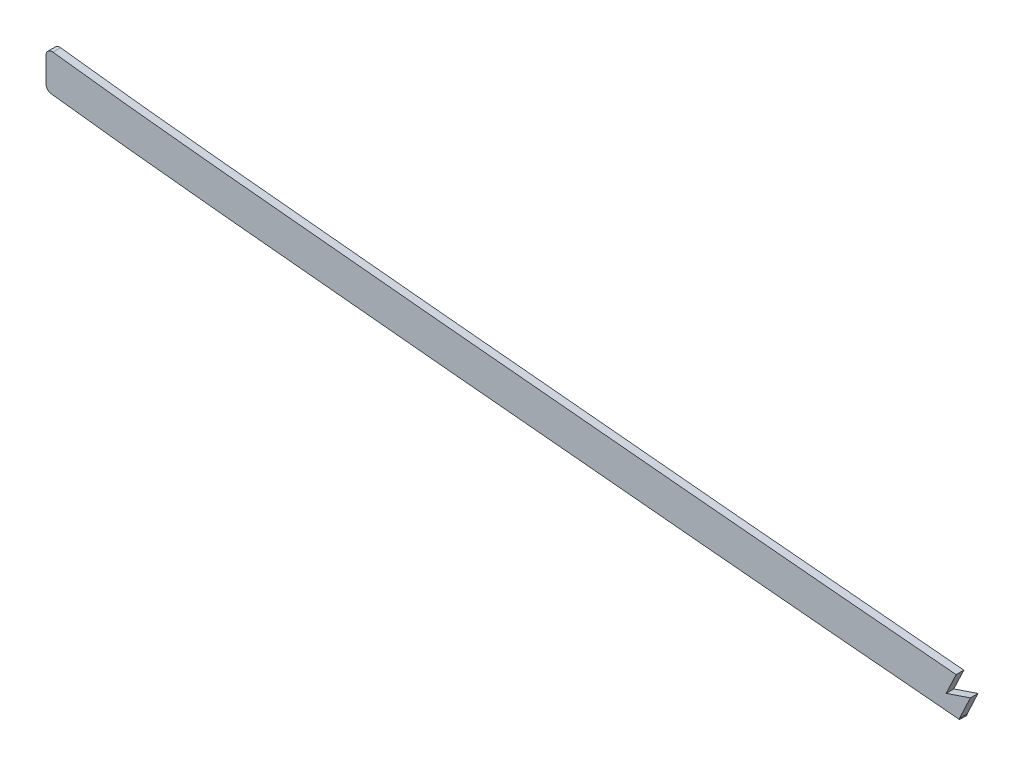
ISO-10303-21;
HEADER;
FILE_DESCRIPTION(('STEP AP214'),'2;1');
FILE_NAME('part.step','',(''),(''),'','','');
FILE_SCHEMA(('AUTOMOTIVE_DESIGN { 1 0 10303 214 1 1 1 1 }'));
ENDSEC;
DATA;
#1=APPLICATION_CONTEXT('core data for automotive mechanical design processes');
#2=APPLICATION_PROTOCOL_DEFINITION('international standard','automotive_design',2000,#1);
#3=PRODUCT_CONTEXT('',#1,'mechanical');
#4=PRODUCT('Part','Part','',(#3));
#5=PRODUCT_RELATED_PRODUCT_CATEGORY('part','',(#4));
#6=PRODUCT_DEFINITION_FORMATION('','',#4);
#7=PRODUCT_DEFINITION_CONTEXT('part definition',#1,'design');
#8=PRODUCT_DEFINITION('design','',#6,#7);
#9=PRODUCT_DEFINITION_SHAPE('','',#8);
#10=(LENGTH_UNIT() NAMED_UNIT(*) SI_UNIT(.MILLI.,.METRE.));
#11=(NAMED_UNIT(*) PLANE_ANGLE_UNIT() SI_UNIT($,.RADIAN.));
#12=(NAMED_UNIT(*) SI_UNIT($,.STERADIAN.) SOLID_ANGLE_UNIT());
#13=UNCERTAINTY_MEASURE_WITH_UNIT(LENGTH_MEASURE(1.E-05),#10,'distance_accuracy_value','');
#14=(GEOMETRIC_REPRESENTATION_CONTEXT(3) GLOBAL_UNCERTAINTY_ASSIGNED_CONTEXT((#13)) GLOBAL_UNIT_ASSIGNED_CONTEXT((#10,
#11,#12)) REPRESENTATION_CONTEXT('',''));
#15=CARTESIAN_POINT('',(0.,0.,0.));
#16=DIRECTION('',(0.,0.,1.));
#17=DIRECTION('',(1.,0.,0.));
#18=AXIS2_PLACEMENT_3D('',#15,#16,#17);
#19=CARTESIAN_POINT('',(825.5,-2.05798657070006E-12,1.5875));
#20=DIRECTION('',(1.,0.,0.));
#21=DIRECTION('',(0.,1.,0.));
#22=AXIS2_PLACEMENT_3D('',#19,#20,#21);
#23=PLANE('',#22);
#24=DIRECTION('',(0.,-1.,0.));
#25=VECTOR('',#24,1.);
#26=CARTESIAN_POINT('',(825.5,-2.05798657070006E-12,-1.5875));
#27=LINE('',#26,#25);
#28=CARTESIAN_POINT('',(825.5,260.843912709853,-1.5875));
#29=VERTEX_POINT('',#28);
#30=CARTESIAN_POINT('',(825.5,250.60337068014,-1.5875));
#31=VERTEX_POINT('',#30);
#32=EDGE_CURVE('E148',#29,#31,#27,.T.);
#33=ORIENTED_EDGE('',*,*,#32,.T.);
#34=DIRECTION('',(0.,0.,-1.));
#35=VECTOR('',#34,1.);
#36=CARTESIAN_POINT('',(825.5,250.60337068014,1.5875));
#37=LINE('',#36,#35);
#38=CARTESIAN_POINT('',(825.5,250.60337068014,1.5875));
#39=VERTEX_POINT('',#38);
#40=EDGE_CURVE('E209',#31,#39,#37,.F.);
#41=ORIENTED_EDGE('',*,*,#40,.T.);
#42=DIRECTION('',(0.,-1.,0.));
#43=VECTOR('',#42,1.);
#44=CARTESIAN_POINT('',(825.5,-2.05798657070006E-12,1.5875));
#45=LINE('',#44,#43);
#46=CARTESIAN_POINT('',(825.5,260.843912709853,1.5875));
#47=VERTEX_POINT('',#46);
#48=EDGE_CURVE('E224',#47,#39,#45,.T.);
#49=ORIENTED_EDGE('',*,*,#48,.F.);
#50=DIRECTION('',(0.,0.,1.));
#51=VECTOR('',#50,1.);
#52=CARTESIAN_POINT('',(825.5,260.843912709853,-1.5875));
#53=LINE('',#52,#51);
#54=EDGE_CURVE('E204',#47,#29,#53,.F.);
#55=ORIENTED_EDGE('',*,*,#54,.T.);
#56=EDGE_LOOP('',(#33,#41,#49,#55));
#57=FACE_BOUND('',#56,.T.);
#58=ADVANCED_FACE('F38',(#57),#23,.F.);
#59=CARTESIAN_POINT('',(816.035490090419,249.602504502473,1.5875));
#60=CARTESIAN_POINT('',(820.895958915978,248.948752998504,1.5875));
#61=CARTESIAN_POINT('',(830.611237516535,247.699685180795,1.5875));
#62=CARTESIAN_POINT('',(845.281067269815,245.953419482549,1.5875));
#63=CARTESIAN_POINT('',(860.086531547022,244.295598067093,1.5875));
#64=CARTESIAN_POINT('',(879.83070343434,242.186646027517,1.5875));
#65=CARTESIAN_POINT('',(904.36996709185,239.698279805688,1.5875));
#66=CARTESIAN_POINT('',(933.571022669327,236.832150625483,1.5875));
#67=CARTESIAN_POINT('',(962.642718040815,234.023667740898,1.5875));
#68=CARTESIAN_POINT('',(991.762593942944,231.241975908087,1.5875));
#69=CARTESIAN_POINT('',(1021.07201031471,228.475862291185,1.5875));
#70=CARTESIAN_POINT('',(1060.37643731472,224.796956681051,1.5875));
#71=CARTESIAN_POINT('',(1109.51301557685,220.18437886172,1.5875));
#72=CARTESIAN_POINT('',(1168.51119036116,214.817071985159,1.5875));
#73=CARTESIAN_POINT('',(1227.50012979269,209.662054041939,1.5875));
#74=CARTESIAN_POINT('',(1306.13316794657,203.021178328389,1.5875));
#75=CARTESIAN_POINT('',(1404.36147710547,194.920725932278,1.5875));
#76=CARTESIAN_POINT('',(1522.23985107062,184.918066624094,1.5875));
#77=CARTESIAN_POINT('',(1640.18285649102,175.16700778633,1.5875));
#78=CARTESIAN_POINT('',(1758.16535256682,165.7576394845,1.5875));
#79=CARTESIAN_POINT('',(1876.15538476943,156.590937078959,1.5875));
#80=CARTESIAN_POINT('',(1994.08749188002,147.453250142139,1.5875));
#81=CARTESIAN_POINT('',(2092.26869206097,139.624216053351,1.5875));
#82=CARTESIAN_POINT('',(2170.74802904205,133.07965672904,1.5875));
#83=CARTESIAN_POINT('',(2219.77173097685,128.842227835716,1.5875));
#84=CARTESIAN_POINT('',(2258.98398824696,125.347211495477,1.5875));
#85=CARTESIAN_POINT('',(2288.37945753647,122.670854497073,1.5875));
#86=CARTESIAN_POINT('',(2317.81224311603,119.931729386451,1.5875));
#87=CARTESIAN_POINT('',(2347.55150917161,117.100365282643,1.5875));
#88=CARTESIAN_POINT('',(2377.15989972739,114.210118529692,1.5875));
#89=CARTESIAN_POINT('',(2406.46965385077,111.268968010355,1.5875));
#90=CARTESIAN_POINT('',(2435.81832605954,108.240091266207,1.5875));
#91=CARTESIAN_POINT('',(2474.91392826886,104.090158094027,1.5875));
#92=CARTESIAN_POINT('',(2523.71623221738,98.6932837654834,1.5875));
#93=CARTESIAN_POINT('',(2582.04188116328,91.9122953054182,1.5875));
#94=CARTESIAN_POINT('',(2640.07521554125,84.8575618799937,1.5875));
#95=CARTESIAN_POINT('',(2678.57418525121,79.9813997136137,1.5875));
#96=CARTESIAN_POINT('',(2697.83785996013,77.4903351724698,1.5875));
#97=B_SPLINE_CURVE_WITH_KNOTS('',3,(#59,#60,#61,#62,#63,#64,#65,#66,#67,#68,#69,#70,#71,#72,#73,
#74,#75,#76,#77,#78,#79,#80,#81,#82,#83,#84,#85,#86,#87,#88,#89,#90,#91,#92,#93,#94,#95,#96),
.UNSPECIFIED.,.F.,.F.,(4,1,1,1,1,1,1,1,1,1,1,1,1,1,1,1,1,1,1,1,1,1,1,1,1,1,1,1,1,1,1,1,1,1,1,4),
(77.9308215150932,79.3861761032565,80.8415306914199,82.2968852795832,83.7522398677466,
86.6629490440732,89.5736582203999,92.4843673967266,95.3950765730532,98.3057857493799,
101.216494925707,107.03791327836,112.859331631013,118.680749983667,124.50216833632,
136.145005041627,147.787841746933,159.43067845224,171.073515157547,182.716351862853,
194.35918856816,206.002025273467,211.82344362612,217.644861978773,220.5555711551,
223.466280331427,226.376989507753,229.28769868408,232.198407860407,235.109117036733,
238.01982621306,240.930535389387,246.75195374204,252.573372094693,258.394790447347,264.2162088),.UNSPECIFIED.);
#98=DIRECTION('',(0.,0.,-1.));
#99=VECTOR('',#98,1.);
#100=SURFACE_OF_LINEAR_EXTRUSION('',#97,#99);
#101=CARTESIAN_POINT('',(816.035490090419,249.602504502473,-1.5875));
#102=CARTESIAN_POINT('',(820.895958915978,248.948752998504,-1.5875));
#103=CARTESIAN_POINT('',(830.611237516535,247.699685180795,-1.5875));
#104=CARTESIAN_POINT('',(845.281067269815,245.953419482549,-1.5875));
#105=CARTESIAN_POINT('',(860.086531547022,244.295598067093,-1.5875));
#106=CARTESIAN_POINT('',(879.83070343434,242.186646027517,-1.5875));
#107=CARTESIAN_POINT('',(904.36996709185,239.698279805688,-1.5875));
#108=CARTESIAN_POINT('',(933.571022669327,236.832150625483,-1.5875));
#109=CARTESIAN_POINT('',(962.642718040815,234.023667740898,-1.5875));
#110=CARTESIAN_POINT('',(991.762593942944,231.241975908087,-1.5875));
#111=CARTESIAN_POINT('',(1021.07201031471,228.475862291185,-1.5875));
#112=CARTESIAN_POINT('',(1060.37643731472,224.796956681051,-1.5875));
#113=CARTESIAN_POINT('',(1109.51301557685,220.18437886172,-1.5875));
#114=CARTESIAN_POINT('',(1168.51119036116,214.817071985159,-1.5875));
#115=CARTESIAN_POINT('',(1227.50012979269,209.662054041939,-1.5875));
#116=CARTESIAN_POINT('',(1306.13316794657,203.021178328389,-1.5875));
#117=CARTESIAN_POINT('',(1404.36147710547,194.920725932278,-1.5875));
#118=CARTESIAN_POINT('',(1522.23985107062,184.918066624094,-1.5875));
#119=CARTESIAN_POINT('',(1640.18285649102,175.16700778633,-1.5875));
#120=CARTESIAN_POINT('',(1758.16535256682,165.7576394845,-1.5875));
#121=CARTESIAN_POINT('',(1876.15538476943,156.590937078959,-1.5875));
#122=CARTESIAN_POINT('',(1994.08749188002,147.453250142139,-1.5875));
#123=CARTESIAN_POINT('',(2092.26869206097,139.624216053351,-1.5875));
#124=CARTESIAN_POINT('',(2170.74802904205,133.07965672904,-1.5875));
#125=CARTESIAN_POINT('',(2219.77173097685,128.842227835716,-1.5875));
#126=CARTESIAN_POINT('',(2258.98398824696,125.347211495477,-1.5875));
#127=CARTESIAN_POINT('',(2288.37945753647,122.670854497073,-1.5875));
#128=CARTESIAN_POINT('',(2317.81224311603,119.931729386451,-1.5875));
#129=CARTESIAN_POINT('',(2347.55150917161,117.100365282643,-1.5875));
#130=CARTESIAN_POINT('',(2377.15989972739,114.210118529692,-1.5875));
#131=CARTESIAN_POINT('',(2406.46965385077,111.268968010355,-1.5875));
#132=CARTESIAN_POINT('',(2435.81832605954,108.240091266207,-1.5875));
#133=CARTESIAN_POINT('',(2474.91392826886,104.090158094027,-1.5875));
#134=CARTESIAN_POINT('',(2523.71623221738,98.6932837654834,-1.5875));
#135=CARTESIAN_POINT('',(2582.04188116328,91.9122953054182,-1.5875));
#136=CARTESIAN_POINT('',(2640.07521554125,84.8575618799937,-1.5875));
#137=CARTESIAN_POINT('',(2678.57418525121,79.9813997136137,-1.5875));
#138=CARTESIAN_POINT('',(2697.83785996013,77.4903351724698,-1.5875));
#139=B_SPLINE_CURVE_WITH_KNOTS('',3,(#101,#102,#103,#104,#105,#106,#107,#108,#109,#110,#111,
#112,#113,#114,#115,#116,#117,#118,#119,#120,#121,#122,#123,#124,#125,#126,#127,#128,#129,#130,
#131,#132,#133,#134,#135,#136,#137,#138),.UNSPECIFIED.,.F.,.F.,(4,1,1,1,1,1,1,1,1,1,1,1,1,1,1,1,
1,1,1,1,1,1,1,1,1,1,1,1,1,1,1,1,1,1,1,4),(77.9308215150932,79.3861761032565,80.8415306914199,
82.2968852795832,83.7522398677466,86.6629490440732,89.5736582203999,92.4843673967266,
95.3950765730532,98.3057857493799,101.216494925707,107.03791327836,112.859331631013,
118.680749983667,124.50216833632,136.145005041627,147.787841746933,159.43067845224,
171.073515157547,182.716351862853,194.35918856816,206.002025273467,211.82344362612,
217.644861978773,220.5555711551,223.466280331427,226.376989507753,229.28769868408,
232.198407860407,235.109117036733,238.01982621306,240.930535389387,246.75195374204,
252.573372094693,258.394790447347,264.2162088),.UNSPECIFIED.);
#140=CARTESIAN_POINT('',(827.723143350863,248.083211585183,-1.5875));
#141=VERTEX_POINT('',#140);
#142=CARTESIAN_POINT('',(1203.04497114067,211.807480637657,-1.5875));
#143=VERTEX_POINT('',#142);
#144=EDGE_CURVE('E225',#141,#143,#139,.T.);
#145=ORIENTED_EDGE('',*,*,#144,.T.);
#146=DIRECTION('',(0.,0.,-1.));
#147=VECTOR('',#146,1.);
#148=CARTESIAN_POINT('',(1203.04497114067,211.807480638492,1.5875));
#149=LINE('',#148,#147);
#150=CARTESIAN_POINT('',(1203.04497114067,211.807480637657,1.5875));
#151=VERTEX_POINT('',#150);
#152=EDGE_CURVE('E146',#143,#151,#149,.F.);
#153=ORIENTED_EDGE('',*,*,#152,.T.);
#154=CARTESIAN_POINT('',(827.723143350863,248.083211585183,1.5875));
#155=VERTEX_POINT('',#154);
#156=EDGE_CURVE('E154',#155,#151,#97,.T.);
#157=ORIENTED_EDGE('',*,*,#156,.F.);
#158=DIRECTION('',(0.,0.,-1.));
#159=VECTOR('',#158,1.);
#160=CARTESIAN_POINT('',(827.723143350863,248.083211585183,1.5875));
#161=LINE('',#160,#159);
#162=EDGE_CURVE('E199',#155,#141,#161,.T.);
#163=ORIENTED_EDGE('',*,*,#162,.T.);
#164=EDGE_LOOP('',(#145,#153,#157,#163));
#165=FACE_BOUND('',#164,.T.);
#166=ADVANCED_FACE('F248',(#165),#100,.F.);
#167=CARTESIAN_POINT('',(818.067033698442,264.706491743222,1.5875));
#168=CARTESIAN_POINT('',(827.043059883077,263.499182154688,1.5875));
#169=CARTESIAN_POINT('',(836.029088262746,262.37336018535,1.5875));
#170=CARTESIAN_POINT('',(845.086758911477,261.305822737124,1.5875));
#171=CARTESIAN_POINT('',(891.386485356828,256.087047064925,1.5875));
#172=CARTESIAN_POINT('',(937.686211733138,251.779150949417,1.5875));
#173=CARTESIAN_POINT('',(973.452075064018,248.227669424888,1.5875));
#174=CARTESIAN_POINT('',(1071.94667214103,239.051054037575,1.5875));
#175=CARTESIAN_POINT('',(1170.4412693194,229.731506737662,1.5875));
#176=CARTESIAN_POINT('',(1231.79194034372,224.503945812963,1.5875));
#177=CARTESIAN_POINT('',(1324.89933614602,216.790627817024,1.5875));
#178=CARTESIAN_POINT('',(1418.00673093479,209.040117977579,1.5875));
#179=CARTESIAN_POINT('',(1449.7429359212,206.361809936344,1.5875));
#180=CARTESIAN_POINT('',(1636.92860677809,190.521130341518,1.5875));
#181=CARTESIAN_POINT('',(1824.11427763497,175.409157235081,1.5875));
#182=CARTESIAN_POINT('',(1979.96694737597,164.299650252625,1.5875));
#183=CARTESIAN_POINT('',(2156.26863942885,150.414433314205,1.5875));
#184=CARTESIAN_POINT('',(2332.5703304682,133.85721640186,1.5875));
#185=CARTESIAN_POINT('',(2354.21298315715,131.785082220072,1.5875));
#186=CARTESIAN_POINT('',(2436.3555443117,123.723952135345,1.5875));
#187=CARTESIAN_POINT('',(2518.49810546626,114.859112916573,1.5875));
#188=CARTESIAN_POINT('',(2579.48130742255,107.74251493933,1.5875));
#189=CARTESIAN_POINT('',(2639.63682069028,100.383443901382,1.5875));
#190=CARTESIAN_POINT('',(2699.79233294449,92.6044886503654,1.5875));
#191=(BOUNDED_CURVE() B_SPLINE_CURVE(5,(#167,#168,#169,#170,#171,#172,#173,#174,#175,#176,#177,
#178,#179,#180,#181,#182,#183,#184,#185,#186,#187,#188,#189,#190),.UNSPECIFIED.,.F.,
.F.) B_SPLINE_CURVE_WITH_KNOTS((6,3,3,3,3,3,3,6),(77.9308215150932,82.46579272,100.7932901,
131.0989539,146.7691983,223.5339586,233.9431167,264.2162088),
.UNSPECIFIED.) CURVE() GEOMETRIC_REPRESENTATION_ITEM() RATIONAL_B_SPLINE_CURVE((1.,1.,1.,1.,1.,
1.,1.,1.,1.,1.,1.,1.,1.,1.,1.,1.,1.,1.,1.,1.,1.,1.,1.,1.)) REPRESENTATION_ITEM(''));
#192=DIRECTION('',(0.,0.,-1.));
#193=VECTOR('',#192,1.);
#194=SURFACE_OF_LINEAR_EXTRUSION('',#191,#193);
#195=CARTESIAN_POINT('',(1201.64185894077,227.227714276607,1.5875));
#196=DIRECTION('',(0.,0.,-1.));
#197=VECTOR('',#196,1.);
#198=LINE('',#195,#197);
#199=CARTESIAN_POINT('',(1201.64204831692,227.228175466422,-1.5875));
#200=VERTEX_POINT('',#199);
#201=CARTESIAN_POINT('',(1201.64219509746,227.228546178045,1.5875));
#202=VERTEX_POINT('',#201);
#203=EDGE_CURVE('E129',#200,#202,#198,.F.);
#204=ORIENTED_EDGE('',*,*,#203,.F.);
#205=CARTESIAN_POINT('',(1201.64212049867,227.227691431805,-1.5875));
#206=CARTESIAN_POINT('',(1170.85395880017,229.91676863308,-1.5875));
#207=CARTESIAN_POINT('',(1140.06546532683,232.671719608956,-1.5875));
#208=CARTESIAN_POINT('',(1109.27511038831,235.505261005911,-1.5875));
#209=CARTESIAN_POINT('',(1041.36359270207,241.900440356213,-1.5875));
#210=CARTESIAN_POINT('',(973.452075064018,248.227669424888,-1.5875));
#211=CARTESIAN_POINT('',(937.686211733138,251.779150949417,-1.5875));
#212=CARTESIAN_POINT('',(893.490024640959,255.891326065685,-1.5875));
#213=CARTESIAN_POINT('',(849.293837485869,260.833492812389,-1.5875));
#214=CARTESIAN_POINT('',(842.271288498084,261.644950852474,-1.5875));
#215=CARTESIAN_POINT('',(835.300558160862,262.484907192176,-1.5875));
#216=CARTESIAN_POINT('',(828.359050795809,263.363794966963,-1.5875));
#217=(BOUNDED_CURVE() B_SPLINE_CURVE(5,(#205,#206,#207,#208,#209,#210,#211,#212,#213,#214,#215,
#216),.UNSPECIFIED.,.F.,.F.) B_SPLINE_CURVE_WITH_KNOTS((6,3,3,6),(78.9695339344642,
94.1743508263573,112.501848206357,115.998106991893),
.UNSPECIFIED.) CURVE() GEOMETRIC_REPRESENTATION_ITEM() RATIONAL_B_SPLINE_CURVE((1.,1.,1.,1.,1.,
1.,1.,1.,1.,1.,1.,1.)) REPRESENTATION_ITEM(''));
#218=CARTESIAN_POINT('',(828.359066083151,263.363915707288,-1.5875));
#219=VERTEX_POINT('',#218);
#220=EDGE_CURVE('E218',#219,#200,#217,.F.);
#221=ORIENTED_EDGE('',*,*,#220,.F.);
#222=DIRECTION('',(0.,0.,-1.));
#223=VECTOR('',#222,1.);
#224=CARTESIAN_POINT('',(828.359050832714,263.36379496229,-1.5875));
#225=LINE('',#224,#223);
#226=CARTESIAN_POINT('',(828.359066063904,263.363915645693,1.5875));
#227=VERTEX_POINT('',#226);
#228=EDGE_CURVE('E65',#219,#227,#225,.F.);
#229=ORIENTED_EDGE('',*,*,#228,.T.);
#230=CARTESIAN_POINT('',(828.359050802975,263.363794966055,1.5875));
#231=CARTESIAN_POINT('',(835.300558166619,262.484907191483,1.5875));
#232=CARTESIAN_POINT('',(842.271288502434,261.644950851971,1.5875));
#233=CARTESIAN_POINT('',(849.293837488792,260.833492812062,1.5875));
#234=CARTESIAN_POINT('',(893.490024642421,255.891326065549,1.5875));
#235=CARTESIAN_POINT('',(937.686211733138,251.779150949417,1.5875));
#236=CARTESIAN_POINT('',(973.452075064018,248.227669424888,1.5875));
#237=CARTESIAN_POINT('',(1041.36359268447,241.900440357853,1.5875));
#238=CARTESIAN_POINT('',(1109.2751103531,235.505261009227,1.5875));
#239=CARTESIAN_POINT('',(1140.06546527402,232.671719613816,1.5875));
#240=CARTESIAN_POINT('',(1170.85395872976,229.91676863938,1.5875));
#241=CARTESIAN_POINT('',(1201.64212041066,227.227691439492,1.5875));
#242=(BOUNDED_CURVE() B_SPLINE_CURVE(5,(#230,#231,#232,#233,#234,#235,#236,#237,#238,#239,#240,
#241),.UNSPECIFIED.,.F.,.F.) B_SPLINE_CURVE_WITH_KNOTS((6,3,3,6),(78.9695339351861,82.46579272,
100.7932901,115.9981069832),
.UNSPECIFIED.) CURVE() GEOMETRIC_REPRESENTATION_ITEM() RATIONAL_B_SPLINE_CURVE((1.,1.,1.,1.,1.,
1.,1.,1.,1.,1.,1.,1.)) REPRESENTATION_ITEM(''));
#243=EDGE_CURVE('E193',#227,#202,#242,.T.);
#244=ORIENTED_EDGE('',*,*,#243,.T.);
#245=EDGE_LOOP('',(#204,#221,#229,#244));
#246=FACE_BOUND('',#245,.T.);
#247=ADVANCED_FACE('F173',(#246),#194,.T.);
#248=CARTESIAN_POINT('',(0.,0.,1.5875));
#249=DIRECTION('',(0.,0.,1.));
#250=DIRECTION('',(1.,0.,0.));
#251=AXIS2_PLACEMENT_3D('',#248,#249,#250);
#252=PLANE('',#251);
#253=DIRECTION('',(0.,-1.,0.));
#254=VECTOR('',#253,1.);
#255=CARTESIAN_POINT('',(1203.04497114067,209.528496049617,1.5875));
#256=LINE('',#255,#254);
#257=CARTESIAN_POINT('',(1203.04497114067,212.261982037228,1.5875));
#258=VERTEX_POINT('',#257);
#259=EDGE_CURVE('E123',#258,#151,#256,.T.);
#260=ORIENTED_EDGE('',*,*,#259,.F.);
#261=DIRECTION('',(-0.422321486152188,-0.906446116619299,0.));
#262=VECTOR('',#261,1.);
#263=CARTESIAN_POINT('',(1207.4958020239,221.814984908549,1.5875));
#264=LINE('',#263,#262);
#265=CARTESIAN_POINT('',(1207.4958020239,221.814984908549,1.5875));
#266=VERTEX_POINT('',#265);
#267=EDGE_CURVE('E136',#266,#258,#264,.T.);
#268=ORIENTED_EDGE('',*,*,#267,.F.);
#269=DIRECTION('',(0.947648212829273,0.319316245627254,0.));
#270=VECTOR('',#269,1.);
#271=CARTESIAN_POINT('',(1197.50857174933,218.449722533425,1.5875));
#272=LINE('',#271,#270);
#273=CARTESIAN_POINT('',(1197.50857174933,218.449722533425,1.5875));
#274=VERTEX_POINT('',#273);
#275=EDGE_CURVE('E117',#274,#266,#272,.T.);
#276=ORIENTED_EDGE('',*,*,#275,.F.);
#277=DIRECTION('',(-0.426005239002973,-0.904720695210417,0.));
#278=VECTOR('',#277,1.);
#279=CARTESIAN_POINT('',(1201.64190146374,227.227804562421,1.5875));
#280=LINE('',#279,#278);
#281=EDGE_CURVE('E126',#202,#274,#280,.T.);
#282=ORIENTED_EDGE('',*,*,#281,.F.);
#283=ORIENTED_EDGE('',*,*,#243,.F.);
#284=CARTESIAN_POINT('',(828.04,260.843912709853,1.5875));
#285=DIRECTION('',(0.,0.,1.));
#286=DIRECTION('',(1.,0.,0.));
#287=AXIS2_PLACEMENT_3D('',#284,#285,#286);
#288=CIRCLE('',#287,2.54);
#289=EDGE_CURVE('E196',#227,#47,#288,.T.);
#290=ORIENTED_EDGE('',*,*,#289,.T.);
#291=ORIENTED_EDGE('',*,*,#48,.T.);
#292=CARTESIAN_POINT('',(828.04,250.60337068014,1.5875));
#293=DIRECTION('',(0.,0.,1.));
#294=DIRECTION('',(1.,0.,0.));
#295=AXIS2_PLACEMENT_3D('',#292,#293,#294);
#296=CIRCLE('',#295,2.54);
#297=EDGE_CURVE('E198',#39,#155,#296,.T.);
#298=ORIENTED_EDGE('',*,*,#297,.T.);
#299=ORIENTED_EDGE('',*,*,#156,.T.);
#300=EDGE_LOOP('',(#260,#268,#276,#282,#283,#290,#291,#298,#299));
#301=FACE_BOUND('',#300,.T.);
#302=ADVANCED_FACE('F134',(#301),#252,.T.);
#303=CARTESIAN_POINT('',(0.,0.,-1.5875));
#304=DIRECTION('',(0.,0.,1.));
#305=DIRECTION('',(1.,0.,0.));
#306=AXIS2_PLACEMENT_3D('',#303,#304,#305);
#307=PLANE('',#306);
#308=DIRECTION('',(-0.422321486152188,-0.906446116619299,0.));
#309=VECTOR('',#308,1.);
#310=CARTESIAN_POINT('',(907.218994729217,-422.681577089763,-1.5875));
#311=LINE('',#310,#309);
#312=CARTESIAN_POINT('',(1207.4958020239,221.814984908549,-1.5875));
#313=VERTEX_POINT('',#312);
#314=CARTESIAN_POINT('',(1203.04497114067,212.261982037228,-1.5875));
#315=VERTEX_POINT('',#314);
#316=EDGE_CURVE('E49',#313,#315,#311,.T.);
#317=ORIENTED_EDGE('',*,*,#316,.T.);
#318=DIRECTION('',(0.,-1.,0.));
#319=VECTOR('',#318,1.);
#320=CARTESIAN_POINT('',(1203.04497114067,0.,-1.5875));
#321=LINE('',#320,#319);
#322=EDGE_CURVE('E11',#315,#143,#321,.T.);
#323=ORIENTED_EDGE('',*,*,#322,.T.);
#324=ORIENTED_EDGE('',*,*,#144,.F.);
#325=CARTESIAN_POINT('',(828.04,250.60337068014,-1.5875));
#326=DIRECTION('',(0.,0.,1.));
#327=DIRECTION('',(1.,0.,0.));
#328=AXIS2_PLACEMENT_3D('',#325,#326,#327);
#329=CIRCLE('',#328,2.54);
#330=EDGE_CURVE('E277',#141,#31,#329,.F.);
#331=ORIENTED_EDGE('',*,*,#330,.T.);
#332=ORIENTED_EDGE('',*,*,#32,.F.);
#333=CARTESIAN_POINT('',(828.04,260.843912709853,-1.5875));
#334=DIRECTION('',(0.,0.,1.));
#335=DIRECTION('',(1.,0.,0.));
#336=AXIS2_PLACEMENT_3D('',#333,#334,#335);
#337=CIRCLE('',#336,2.54);
#338=EDGE_CURVE('E223',#29,#219,#337,.F.);
#339=ORIENTED_EDGE('',*,*,#338,.T.);
#340=ORIENTED_EDGE('',*,*,#220,.T.);
#341=DIRECTION('',(-0.426005239002973,-0.904720695210417,0.));
#342=VECTOR('',#341,1.);
#343=CARTESIAN_POINT('',(895.990195956948,-421.894314558801,-1.5875));
#344=LINE('',#343,#342);
#345=CARTESIAN_POINT('',(1197.50857174933,218.449722533425,-1.5875));
#346=VERTEX_POINT('',#345);
#347=EDGE_CURVE('E211',#200,#346,#344,.T.);
#348=ORIENTED_EDGE('',*,*,#347,.T.);
#349=DIRECTION('',(0.947648212829273,0.319316245627254,0.));
#350=VECTOR('',#349,1.);
#351=CARTESIAN_POINT('',(55.9986343539285,-166.189495501982,-1.5875));
#352=LINE('',#351,#350);
#353=EDGE_CURVE('E120',#346,#313,#352,.T.);
#354=ORIENTED_EDGE('',*,*,#353,.T.);
#355=EDGE_LOOP('',(#317,#323,#324,#331,#332,#339,#340,#348,#354));
#356=FACE_BOUND('',#355,.T.);
#357=ADVANCED_FACE('F172',(#356),#307,.F.);
#358=CARTESIAN_POINT('',(828.04,250.60337068014,0.));
#359=DIRECTION('',(0.,0.,-1.));
#360=DIRECTION('',(-1.,0.,0.));
#361=AXIS2_PLACEMENT_3D('',#358,#359,#360);
#362=CYLINDRICAL_SURFACE('',#361,2.54);
#363=ORIENTED_EDGE('',*,*,#297,.F.);
#364=ORIENTED_EDGE('',*,*,#40,.F.);
#365=ORIENTED_EDGE('',*,*,#330,.F.);
#366=ORIENTED_EDGE('',*,*,#162,.F.);
#367=EDGE_LOOP('',(#363,#364,#365,#366));
#368=FACE_BOUND('',#367,.T.);
#369=ADVANCED_FACE('F275',(#368),#362,.T.);
#370=CARTESIAN_POINT('',(828.04,260.843912709853,0.));
#371=DIRECTION('',(0.,0.,-1.));
#372=DIRECTION('',(-1.,0.,0.));
#373=AXIS2_PLACEMENT_3D('',#370,#371,#372);
#374=CYLINDRICAL_SURFACE('',#373,2.54);
#375=ORIENTED_EDGE('',*,*,#289,.F.);
#376=ORIENTED_EDGE('',*,*,#228,.F.);
#377=ORIENTED_EDGE('',*,*,#338,.F.);
#378=ORIENTED_EDGE('',*,*,#54,.F.);
#379=EDGE_LOOP('',(#375,#376,#377,#378));
#380=FACE_BOUND('',#379,.T.);
#381=ADVANCED_FACE('F40',(#380),#374,.T.);
#382=CARTESIAN_POINT('',(1203.04497114067,209.528496049617,-6.0325));
#383=DIRECTION('',(-1.,0.,0.));
#384=DIRECTION('',(0.,0.,1.));
#385=AXIS2_PLACEMENT_3D('',#382,#383,#384);
#386=PLANE('',#385);
#387=ORIENTED_EDGE('',*,*,#322,.F.);
#388=DIRECTION('',(0.,0.,1.));
#389=VECTOR('',#388,1.);
#390=CARTESIAN_POINT('',(1203.04497114067,212.261982037228,-6.0325));
#391=LINE('',#390,#389);
#392=EDGE_CURVE('E141',#315,#258,#391,.T.);
#393=ORIENTED_EDGE('',*,*,#392,.T.);
#394=ORIENTED_EDGE('',*,*,#259,.T.);
#395=ORIENTED_EDGE('',*,*,#152,.F.);
#396=EDGE_LOOP('',(#387,#393,#394,#395));
#397=FACE_BOUND('',#396,.T.);
#398=ADVANCED_FACE('F286',(#397),#386,.F.);
#399=CARTESIAN_POINT('',(1207.4958020239,221.814984908549,-6.0325));
#400=DIRECTION('',(-0.906446116619299,0.422321486152188,0.));
#401=DIRECTION('',(-0.422321486152188,-0.906446116619299,0.));
#402=AXIS2_PLACEMENT_3D('',#399,#400,#401);
#403=PLANE('',#402);
#404=DIRECTION('',(0.,0.,1.));
#405=VECTOR('',#404,1.);
#406=CARTESIAN_POINT('',(1207.4958020239,221.814984908549,-6.0325));
#407=LINE('',#406,#405);
#408=EDGE_CURVE('E122',#313,#266,#407,.T.);
#409=ORIENTED_EDGE('',*,*,#408,.T.);
#410=ORIENTED_EDGE('',*,*,#267,.T.);
#411=ORIENTED_EDGE('',*,*,#392,.F.);
#412=ORIENTED_EDGE('',*,*,#316,.F.);
#413=EDGE_LOOP('',(#409,#410,#411,#412));
#414=FACE_BOUND('',#413,.T.);
#415=ADVANCED_FACE('F288',(#414),#403,.F.);
#416=CARTESIAN_POINT('',(1197.50857174933,218.449722533425,-6.0325));
#417=DIRECTION('',(0.319316245627254,-0.947648212829273,0.));
#418=DIRECTION('',(0.947648212829273,0.319316245627254,0.));
#419=AXIS2_PLACEMENT_3D('',#416,#417,#418);
#420=PLANE('',#419);
#421=DIRECTION('',(0.,0.,1.));
#422=VECTOR('',#421,1.);
#423=CARTESIAN_POINT('',(1197.50857174933,218.449722533425,-6.0325));
#424=LINE('',#423,#422);
#425=EDGE_CURVE('E57',#346,#274,#424,.T.);
#426=ORIENTED_EDGE('',*,*,#425,.T.);
#427=ORIENTED_EDGE('',*,*,#275,.T.);
#428=ORIENTED_EDGE('',*,*,#408,.F.);
#429=ORIENTED_EDGE('',*,*,#353,.F.);
#430=EDGE_LOOP('',(#426,#427,#428,#429));
#431=FACE_BOUND('',#430,.T.);
#432=ADVANCED_FACE('F114',(#431),#420,.F.);
#433=CARTESIAN_POINT('',(1201.64190146374,227.227804562421,-6.0325));
#434=DIRECTION('',(-0.904720695210417,0.426005239002973,0.));
#435=DIRECTION('',(-0.426005239002973,-0.904720695210417,0.));
#436=AXIS2_PLACEMENT_3D('',#433,#434,#435);
#437=PLANE('',#436);
#438=ORIENTED_EDGE('',*,*,#203,.T.);
#439=ORIENTED_EDGE('',*,*,#281,.T.);
#440=ORIENTED_EDGE('',*,*,#425,.F.);
#441=ORIENTED_EDGE('',*,*,#347,.F.);
#442=EDGE_LOOP('',(#438,#439,#440,#441));
#443=FACE_BOUND('',#442,.T.);
#444=ADVANCED_FACE('F127',(#443),#437,.F.);
#445=CLOSED_SHELL('',(#58,#166,#247,#302,#357,#369,#381,#398,#415,#432,#444));
#446=MANIFOLD_SOLID_BREP('B2',#445);
#447=ADVANCED_BREP_SHAPE_REPRESENTATION('',(#18,#446),#14);
#448=SHAPE_DEFINITION_REPRESENTATION(#9,#447);
ENDSEC;
END-ISO-10303-21;
